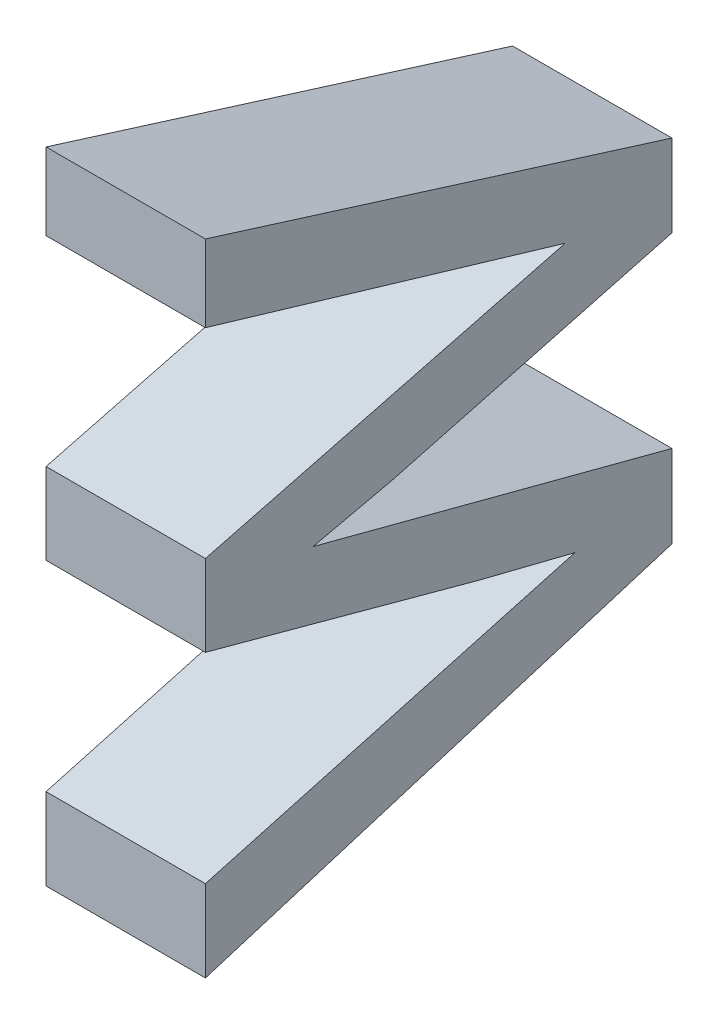
ISO-10303-21;
HEADER;
FILE_DESCRIPTION(('STEP AP214'),'2;1');
FILE_NAME('part.step','',(''),(''),'','','');
FILE_SCHEMA(('AUTOMOTIVE_DESIGN { 1 0 10303 214 1 1 1 1 }'));
ENDSEC;
DATA;
#1=APPLICATION_CONTEXT('core data for automotive mechanical design processes');
#2=APPLICATION_PROTOCOL_DEFINITION('international standard','automotive_design',2000,#1);
#3=PRODUCT_CONTEXT('',#1,'mechanical');
#4=PRODUCT('Part','Part','',(#3));
#5=PRODUCT_RELATED_PRODUCT_CATEGORY('part','',(#4));
#6=PRODUCT_DEFINITION_FORMATION('','',#4);
#7=PRODUCT_DEFINITION_CONTEXT('part definition',#1,'design');
#8=PRODUCT_DEFINITION('design','',#6,#7);
#9=PRODUCT_DEFINITION_SHAPE('','',#8);
#10=(LENGTH_UNIT() NAMED_UNIT(*) SI_UNIT(.MILLI.,.METRE.));
#11=(NAMED_UNIT(*) PLANE_ANGLE_UNIT() SI_UNIT($,.RADIAN.));
#12=(NAMED_UNIT(*) SI_UNIT($,.STERADIAN.) SOLID_ANGLE_UNIT());
#13=UNCERTAINTY_MEASURE_WITH_UNIT(LENGTH_MEASURE(1.E-05),#10,'distance_accuracy_value','');
#14=(GEOMETRIC_REPRESENTATION_CONTEXT(3) GLOBAL_UNCERTAINTY_ASSIGNED_CONTEXT((#13)) GLOBAL_UNIT_ASSIGNED_CONTEXT((#10,
#11,#12)) REPRESENTATION_CONTEXT('',''));
#15=CARTESIAN_POINT('',(0.,0.,0.));
#16=DIRECTION('',(0.,0.,1.));
#17=DIRECTION('',(1.,0.,0.));
#18=AXIS2_PLACEMENT_3D('',#15,#16,#17);
#19=CARTESIAN_POINT('',(4.55229940712934,-40.8328981570271,-8.88282801642506));
#20=DIRECTION('',(-1.,0.,0.));
#21=DIRECTION('',(0.,0.,1.));
#22=AXIS2_PLACEMENT_3D('',#19,#20,#21);
#23=PLANE('',#22);
#24=CARTESIAN_POINT('',(4.55229940712931,-40.570717167468,-9.03684944149135));
#25=CARTESIAN_POINT('',(4.55229940712931,-40.5763680653899,-9.01190279456787));
#26=CARTESIAN_POINT('',(4.55229940712931,-40.5820189633118,-8.98695614764439));
#27=(BOUNDED_CURVE() B_SPLINE_CURVE(2,(#24,#25,#26),.UNSPECIFIED.,.F.,
.F.) B_SPLINE_CURVE_WITH_KNOTS((3,3),(-5.77271874549166,-5.45645160203037),
.UNSPECIFIED.) CURVE() GEOMETRIC_REPRESENTATION_ITEM() RATIONAL_B_SPLINE_CURVE((1.,1.,1.)) REPRESENTATION_ITEM(''));
#28=CARTESIAN_POINT('',(4.55229940712931,-40.570717167468,-9.03684944149135));
#29=VERTEX_POINT('',#28);
#30=CARTESIAN_POINT('',(4.55229940712931,-40.5820189633118,-8.98695614764439));
#31=VERTEX_POINT('',#30);
#32=EDGE_CURVE('E181',#29,#31,#27,.T.);
#33=ORIENTED_EDGE('',*,*,#32,.T.);
#34=CARTESIAN_POINT('',(4.55229940712931,-40.5820189633118,-8.98695614764439));
#35=CARTESIAN_POINT('',(4.55229940712931,-40.6116517207071,-9.09956062574651));
#36=CARTESIAN_POINT('',(4.55229940712932,-40.6412844781024,-9.21216510384864));
#37=(BOUNDED_CURVE() B_SPLINE_CURVE(2,(#34,#35,#36),.UNSPECIFIED.,.F.,
.F.) B_SPLINE_CURVE_WITH_KNOTS((3,3),(-5.45645160203037,-4.01675160835501),
.UNSPECIFIED.) CURVE() GEOMETRIC_REPRESENTATION_ITEM() RATIONAL_B_SPLINE_CURVE((1.,1.,1.)) REPRESENTATION_ITEM(''));
#38=CARTESIAN_POINT('',(4.55229940712932,-40.6412844781024,-9.21216510384864));
#39=VERTEX_POINT('',#38);
#40=EDGE_CURVE('E342',#31,#39,#37,.T.);
#41=ORIENTED_EDGE('',*,*,#40,.T.);
#42=CARTESIAN_POINT('',(4.55229940712932,-40.6412844781024,-9.21216510384864));
#43=CARTESIAN_POINT('',(4.55229940712932,-40.6671959124759,-9.21216510384864));
#44=CARTESIAN_POINT('',(4.55229940712933,-40.6931073468495,-9.21216510384864));
#45=(BOUNDED_CURVE() B_SPLINE_CURVE(2,(#42,#43,#44),.UNSPECIFIED.,.F.,
.F.) B_SPLINE_CURVE_WITH_KNOTS((3,3),(-4.01675160835501,-3.69636987693033),
.UNSPECIFIED.) CURVE() GEOMETRIC_REPRESENTATION_ITEM() RATIONAL_B_SPLINE_CURVE((1.,1.,1.)) REPRESENTATION_ITEM(''));
#46=CARTESIAN_POINT('',(4.55229940712933,-40.6931073468495,-9.21216510384864));
#47=VERTEX_POINT('',#46);
#48=EDGE_CURVE('E391',#39,#47,#45,.T.);
#49=ORIENTED_EDGE('',*,*,#48,.T.);
#50=CARTESIAN_POINT('',(4.55229940712933,-40.6931073468495,-9.21216510384864));
#51=CARTESIAN_POINT('',(4.55229940712933,-40.7379010498889,-9.06579306499374));
#52=CARTESIAN_POINT('',(4.55229940712934,-40.7826947529283,-8.91942102613884));
#53=(BOUNDED_CURVE() B_SPLINE_CURVE(2,(#50,#51,#52),.UNSPECIFIED.,.F.,
.F.) B_SPLINE_CURVE_WITH_KNOTS((3,3),(-3.69636987693033,-1.80370372923866),
.UNSPECIFIED.) CURVE() GEOMETRIC_REPRESENTATION_ITEM() RATIONAL_B_SPLINE_CURVE((1.,1.,1.)) REPRESENTATION_ITEM(''));
#54=CARTESIAN_POINT('',(4.55229940712934,-40.7826947529283,-8.91942102613884));
#55=VERTEX_POINT('',#54);
#56=EDGE_CURVE('E290',#47,#55,#53,.T.);
#57=ORIENTED_EDGE('',*,*,#56,.T.);
#58=CARTESIAN_POINT('',(4.55229940712934,-40.7826947529283,-8.91942102613884));
#59=CARTESIAN_POINT('',(4.55229940712933,-40.7570589721119,-8.91942102613884));
#60=CARTESIAN_POINT('',(4.55229940712933,-40.7314231912955,-8.91942102613884));
#61=(BOUNDED_CURVE() B_SPLINE_CURVE(2,(#58,#59,#60),.UNSPECIFIED.,.F.,
.F.) B_SPLINE_CURVE_WITH_KNOTS((3,3),(-1.80370372923866,-1.48673031410574),
.UNSPECIFIED.) CURVE() GEOMETRIC_REPRESENTATION_ITEM() RATIONAL_B_SPLINE_CURVE((1.,1.,1.)) REPRESENTATION_ITEM(''));
#62=CARTESIAN_POINT('',(4.55229940712933,-40.7314231912955,-8.91942102613884));
#63=VERTEX_POINT('',#62);
#64=EDGE_CURVE('E139',#55,#63,#61,.T.);
#65=ORIENTED_EDGE('',*,*,#64,.T.);
#66=CARTESIAN_POINT('',(4.55229940712933,-40.7314231912955,-8.91942102613884));
#67=CARTESIAN_POINT('',(4.55229940712933,-40.708130465715,-9.00390884141007));
#68=CARTESIAN_POINT('',(4.55229940712932,-40.6761546530838,-9.11982116219818));
#69=CARTESIAN_POINT('',(4.55229940712932,-40.6674715660331,-9.15124566771505));
#70=(BOUNDED_CURVE() B_SPLINE_CURVE(2,(#66,#67,#68,#69),.UNSPECIFIED.,.F.,
.F.) B_SPLINE_CURVE_WITH_KNOTS((3,1,3),(-1.48673031410574,-0.403108154147677,0.),
.UNSPECIFIED.) CURVE() GEOMETRIC_REPRESENTATION_ITEM() RATIONAL_B_SPLINE_CURVE((1.,1.,1.,1.)) REPRESENTATION_ITEM(''));
#71=CARTESIAN_POINT('',(4.55229940712932,-40.6674715660331,-9.15124566771505));
#72=VERTEX_POINT('',#71);
#73=EDGE_CURVE('E310',#63,#72,#70,.T.);
#74=ORIENTED_EDGE('',*,*,#73,.T.);
#75=CARTESIAN_POINT('',(4.55229940712932,-40.6674715660331,-9.15124566771505));
#76=CARTESIAN_POINT('',(4.55229940712932,-40.6663689518044,-9.14655955724323));
#77=CARTESIAN_POINT('',(4.55229940712932,-40.652310620389,-9.0908775386958));
#78=(BOUNDED_CURVE() B_SPLINE_CURVE(2,(#75,#76,#77),.UNSPECIFIED.,.F.,
.F.) B_SPLINE_CURVE_WITH_KNOTS((3,3),(0.,1.),
.UNSPECIFIED.) CURVE() GEOMETRIC_REPRESENTATION_ITEM() RATIONAL_B_SPLINE_CURVE((1.,1.,1.)) REPRESENTATION_ITEM(''));
#79=CARTESIAN_POINT('',(4.55229940712932,-40.652310620389,-9.0908775386958));
#80=VERTEX_POINT('',#79);
#81=EDGE_CURVE('E200',#72,#80,#78,.T.);
#82=ORIENTED_EDGE('',*,*,#81,.T.);
#83=CARTESIAN_POINT('',(4.55229940712932,-40.652310620389,-9.0908775386958));
#84=CARTESIAN_POINT('',(4.55229940712932,-40.6290178948085,-9.00514928241732));
#85=CARTESIAN_POINT('',(4.55229940712931,-40.605725169228,-8.91942102613883));
#86=(BOUNDED_CURVE() B_SPLINE_CURVE(2,(#83,#84,#85),.UNSPECIFIED.,.F.,
.F.) B_SPLINE_CURVE_WITH_KNOTS((3,3),(1.,2.09841552621187),
.UNSPECIFIED.) CURVE() GEOMETRIC_REPRESENTATION_ITEM() RATIONAL_B_SPLINE_CURVE((1.,1.,1.)) REPRESENTATION_ITEM(''));
#87=CARTESIAN_POINT('',(4.55229940712931,-40.605725169228,-8.91942102613883));
#88=VERTEX_POINT('',#87);
#89=EDGE_CURVE('E219',#80,#88,#86,.T.);
#90=ORIENTED_EDGE('',*,*,#89,.T.);
#91=CARTESIAN_POINT('',(4.55229940712931,-40.605725169228,-8.91942102613883));
#92=CARTESIAN_POINT('',(4.55229940712931,-40.5802272151902,-8.91942102613884));
#93=CARTESIAN_POINT('',(4.55229940712931,-40.5547292611524,-8.91942102613883));
#94=(BOUNDED_CURVE() B_SPLINE_CURVE(2,(#91,#92,#93),.UNSPECIFIED.,.F.,
.F.) B_SPLINE_CURVE_WITH_KNOTS((3,3),(2.09841552621187,2.41368478319891),
.UNSPECIFIED.) CURVE() GEOMETRIC_REPRESENTATION_ITEM() RATIONAL_B_SPLINE_CURVE((1.,1.,1.)) REPRESENTATION_ITEM(''));
#95=CARTESIAN_POINT('',(4.55229940712931,-40.5547292611524,-8.91942102613883));
#96=VERTEX_POINT('',#95);
#97=EDGE_CURVE('E260',#88,#96,#94,.T.);
#98=ORIENTED_EDGE('',*,*,#97,.T.);
#99=CARTESIAN_POINT('',(4.55229940712931,-40.5547292611524,-8.91942102613883));
#100=CARTESIAN_POINT('',(4.5522994071293,-40.5328148033577,-9.00432232174582));
#101=CARTESIAN_POINT('',(4.5522994071293,-40.5035955262982,-9.11720245340511));
#102=CARTESIAN_POINT('',(4.5522994071293,-40.4962907070333,-9.14518128945741));
#103=(BOUNDED_CURVE() B_SPLINE_CURVE(2,(#99,#100,#101,#102),.UNSPECIFIED.,.F.,
.F.) B_SPLINE_CURVE_WITH_KNOTS((3,1,3),(2.41368478319891,3.49785219491702,3.85539253415245),
.UNSPECIFIED.) CURVE() GEOMETRIC_REPRESENTATION_ITEM() RATIONAL_B_SPLINE_CURVE((1.,1.,1.,1.)) REPRESENTATION_ITEM(''));
#104=CARTESIAN_POINT('',(4.5522994071293,-40.4962907070333,-9.14518128945741));
#105=VERTEX_POINT('',#104);
#106=EDGE_CURVE('E362',#96,#105,#103,.T.);
#107=ORIENTED_EDGE('',*,*,#106,.T.);
#108=CARTESIAN_POINT('',(4.5522994071293,-40.4962907070333,-9.14518128945741));
#109=CARTESIAN_POINT('',(4.5522994071293,-40.4878832735397,-9.11692679984794));
#110=CARTESIAN_POINT('',(4.55229940712929,-40.4543913663441,-9.00404666818865));
#111=CARTESIAN_POINT('',(4.55229940712929,-40.4293068926421,-8.91942102613884));
#112=(BOUNDED_CURVE() B_SPLINE_CURVE(2,(#108,#109,#110,#111),.UNSPECIFIED.,.F.,
.F.) B_SPLINE_CURVE_WITH_KNOTS((3,1,3),(3.85539253415245,4.2198832391048,5.31123654712288),
.UNSPECIFIED.) CURVE() GEOMETRIC_REPRESENTATION_ITEM() RATIONAL_B_SPLINE_CURVE((1.,1.,1.,1.)) REPRESENTATION_ITEM(''));
#113=CARTESIAN_POINT('',(4.55229940712929,-40.4293068926421,-8.91942102613884));
#114=VERTEX_POINT('',#113);
#115=EDGE_CURVE('E230',#105,#114,#112,.T.);
#116=ORIENTED_EDGE('',*,*,#115,.T.);
#117=CARTESIAN_POINT('',(4.55229940712929,-40.4293068926421,-8.91942102613884));
#118=CARTESIAN_POINT('',(4.55229940712928,-40.4051872063901,-8.91942102613884));
#119=CARTESIAN_POINT('',(4.55229940712928,-40.3810675201381,-8.91942102613883));
#120=(BOUNDED_CURVE() B_SPLINE_CURVE(2,(#117,#118,#119),.UNSPECIFIED.,.F.,
.F.) B_SPLINE_CURVE_WITH_KNOTS((3,3),(5.31123654712288,5.60946422265117),
.UNSPECIFIED.) CURVE() GEOMETRIC_REPRESENTATION_ITEM() RATIONAL_B_SPLINE_CURVE((1.,1.,1.)) REPRESENTATION_ITEM(''));
#121=CARTESIAN_POINT('',(4.55229940712928,-40.3810675201381,-8.91942102613883));
#122=VERTEX_POINT('',#121);
#123=EDGE_CURVE('E239',#114,#122,#120,.T.);
#124=ORIENTED_EDGE('',*,*,#123,.T.);
#125=CARTESIAN_POINT('',(4.55229940712928,-40.3810675201381,-8.91942102613883));
#126=CARTESIAN_POINT('',(4.55229940712929,-40.4268260106276,-9.06579306499374));
#127=CARTESIAN_POINT('',(4.5522994071293,-40.472584501117,-9.21216510384864));
#128=(BOUNDED_CURVE() B_SPLINE_CURVE(2,(#125,#126,#127),.UNSPECIFIED.,.F.,
.F.) B_SPLINE_CURVE_WITH_KNOTS((3,3),(5.60946422265117,7.50565549870941),
.UNSPECIFIED.) CURVE() GEOMETRIC_REPRESENTATION_ITEM() RATIONAL_B_SPLINE_CURVE((1.,1.,1.)) REPRESENTATION_ITEM(''));
#129=CARTESIAN_POINT('',(4.5522994071293,-40.472584501117,-9.21216510384864));
#130=VERTEX_POINT('',#129);
#131=EDGE_CURVE('E332',#122,#130,#128,.T.);
#132=ORIENTED_EDGE('',*,*,#131,.T.);
#133=CARTESIAN_POINT('',(4.5522994071293,-40.472584501117,-9.21216510384864));
#134=CARTESIAN_POINT('',(4.5522994071293,-40.498358108712,-9.21216510384864));
#135=CARTESIAN_POINT('',(4.5522994071293,-40.524131716307,-9.21216510384864));
#136=(BOUNDED_CURVE() B_SPLINE_CURVE(2,(#133,#134,#135),.UNSPECIFIED.,.F.,
.F.) B_SPLINE_CURVE_WITH_KNOTS((3,3),(7.50565549870941,7.8243330719882),
.UNSPECIFIED.) CURVE() GEOMETRIC_REPRESENTATION_ITEM() RATIONAL_B_SPLINE_CURVE((1.,1.,1.)) REPRESENTATION_ITEM(''));
#137=CARTESIAN_POINT('',(4.5522994071293,-40.524131716307,-9.21216510384864));
#138=VERTEX_POINT('',#137);
#139=EDGE_CURVE('E173',#130,#138,#136,.T.);
#140=ORIENTED_EDGE('',*,*,#139,.T.);
#141=CARTESIAN_POINT('',(4.5522994071293,-40.524131716307,-9.21216510384864));
#142=CARTESIAN_POINT('',(4.55229940712931,-40.5474244418875,-9.12450727267));
#143=CARTESIAN_POINT('',(4.55229940712931,-40.570717167468,-9.03684944149135));
#144=(BOUNDED_CURVE() B_SPLINE_CURVE(2,(#141,#142,#143),.UNSPECIFIED.,.F.,
.F.) B_SPLINE_CURVE_WITH_KNOTS((3,3),(7.8243330719882,8.94578955613703),
.UNSPECIFIED.) CURVE() GEOMETRIC_REPRESENTATION_ITEM() RATIONAL_B_SPLINE_CURVE((1.,1.,1.)) REPRESENTATION_ITEM(''));
#145=EDGE_CURVE('E11',#138,#29,#144,.T.);
#146=ORIENTED_EDGE('',*,*,#145,.T.);
#147=EDGE_LOOP('',(#33,#41,#49,#57,#65,#74,#82,#90,#98,#107,#116,#124,#132,#140,#146));
#148=FACE_BOUND('',#147,.T.);
#149=ADVANCED_FACE('F16',(#148),#23,.T.);
#150=CARTESIAN_POINT('',(4.65229940712935,-40.8328981570271,-8.88282801642507));
#151=DIRECTION('',(1.,0.,0.));
#152=DIRECTION('',(0.,1.,0.));
#153=AXIS2_PLACEMENT_3D('',#150,#151,#152);
#154=PLANE('',#153);
#155=CARTESIAN_POINT('',(4.65229940712931,-40.524131716307,-9.21216510384864));
#156=CARTESIAN_POINT('',(4.65229940712931,-40.5474244418875,-9.12450727267));
#157=CARTESIAN_POINT('',(4.65229940712931,-40.570717167468,-9.03684944149136));
#158=(BOUNDED_CURVE() B_SPLINE_CURVE(2,(#155,#156,#157),.UNSPECIFIED.,.F.,
.F.) B_SPLINE_CURVE_WITH_KNOTS((3,3),(7.8243330719882,8.94578955613703),
.UNSPECIFIED.) CURVE() GEOMETRIC_REPRESENTATION_ITEM() RATIONAL_B_SPLINE_CURVE((1.,1.,1.)) REPRESENTATION_ITEM(''));
#159=CARTESIAN_POINT('',(4.65229940712931,-40.524131716307,-9.21216510384864));
#160=VERTEX_POINT('',#159);
#161=CARTESIAN_POINT('',(4.65229940712931,-40.570717167468,-9.03684944149136));
#162=VERTEX_POINT('',#161);
#163=EDGE_CURVE('E31',#160,#162,#158,.T.);
#164=ORIENTED_EDGE('',*,*,#163,.F.);
#165=CARTESIAN_POINT('',(4.6522994071293,-40.472584501117,-9.21216510384864));
#166=CARTESIAN_POINT('',(4.6522994071293,-40.498358108712,-9.21216510384864));
#167=CARTESIAN_POINT('',(4.65229940712931,-40.524131716307,-9.21216510384864));
#168=(BOUNDED_CURVE() B_SPLINE_CURVE(2,(#165,#166,#167),.UNSPECIFIED.,.F.,
.F.) B_SPLINE_CURVE_WITH_KNOTS((3,3),(7.50565549870941,7.8243330719882),
.UNSPECIFIED.) CURVE() GEOMETRIC_REPRESENTATION_ITEM() RATIONAL_B_SPLINE_CURVE((1.,1.,1.)) REPRESENTATION_ITEM(''));
#169=CARTESIAN_POINT('',(4.6522994071293,-40.472584501117,-9.21216510384864));
#170=VERTEX_POINT('',#169);
#171=EDGE_CURVE('E341',#170,#160,#168,.T.);
#172=ORIENTED_EDGE('',*,*,#171,.F.);
#173=CARTESIAN_POINT('',(4.65229940712928,-40.3810675201381,-8.91942102613883));
#174=CARTESIAN_POINT('',(4.65229940712929,-40.4268260106276,-9.06579306499374));
#175=CARTESIAN_POINT('',(4.6522994071293,-40.472584501117,-9.21216510384864));
#176=(BOUNDED_CURVE() B_SPLINE_CURVE(2,(#173,#174,#175),.UNSPECIFIED.,.F.,
.F.) B_SPLINE_CURVE_WITH_KNOTS((3,3),(5.60946422265117,7.50565549870941),
.UNSPECIFIED.) CURVE() GEOMETRIC_REPRESENTATION_ITEM() RATIONAL_B_SPLINE_CURVE((1.,1.,1.)) REPRESENTATION_ITEM(''));
#177=CARTESIAN_POINT('',(4.65229940712928,-40.3810675201381,-8.91942102613883));
#178=VERTEX_POINT('',#177);
#179=EDGE_CURVE('E240',#178,#170,#176,.T.);
#180=ORIENTED_EDGE('',*,*,#179,.F.);
#181=CARTESIAN_POINT('',(4.65229940712929,-40.429306892642,-8.91942102613884));
#182=CARTESIAN_POINT('',(4.65229940712929,-40.4051872063901,-8.91942102613884));
#183=CARTESIAN_POINT('',(4.65229940712928,-40.3810675201381,-8.91942102613883));
#184=(BOUNDED_CURVE() B_SPLINE_CURVE(2,(#181,#182,#183),.UNSPECIFIED.,.F.,
.F.) B_SPLINE_CURVE_WITH_KNOTS((3,3),(5.31123654712288,5.60946422265117),
.UNSPECIFIED.) CURVE() GEOMETRIC_REPRESENTATION_ITEM() RATIONAL_B_SPLINE_CURVE((1.,1.,1.)) REPRESENTATION_ITEM(''));
#185=CARTESIAN_POINT('',(4.65229940712929,-40.429306892642,-8.91942102613884));
#186=VERTEX_POINT('',#185);
#187=EDGE_CURVE('E220',#186,#178,#184,.T.);
#188=ORIENTED_EDGE('',*,*,#187,.F.);
#189=CARTESIAN_POINT('',(4.6522994071293,-40.4962907070333,-9.14518128945742));
#190=CARTESIAN_POINT('',(4.6522994071293,-40.4878832735397,-9.11692679984795));
#191=CARTESIAN_POINT('',(4.65229940712929,-40.4543913663441,-9.00404666818866));
#192=CARTESIAN_POINT('',(4.65229940712929,-40.429306892642,-8.91942102613884));
#193=(BOUNDED_CURVE() B_SPLINE_CURVE(2,(#189,#190,#191,#192),.UNSPECIFIED.,.F.,
.F.) B_SPLINE_CURVE_WITH_KNOTS((3,1,3),(3.85539253415245,4.2198832391048,5.31123654712288),
.UNSPECIFIED.) CURVE() GEOMETRIC_REPRESENTATION_ITEM() RATIONAL_B_SPLINE_CURVE((1.,1.,1.,1.)) REPRESENTATION_ITEM(''));
#194=CARTESIAN_POINT('',(4.6522994071293,-40.4962907070333,-9.14518128945742));
#195=VERTEX_POINT('',#194);
#196=EDGE_CURVE('E353',#195,#186,#193,.T.);
#197=ORIENTED_EDGE('',*,*,#196,.F.);
#198=CARTESIAN_POINT('',(4.65229940712931,-40.5547292611524,-8.91942102613883));
#199=CARTESIAN_POINT('',(4.6522994071293,-40.5328148033577,-9.00432232174582));
#200=CARTESIAN_POINT('',(4.6522994071293,-40.5035955262982,-9.11720245340511));
#201=CARTESIAN_POINT('',(4.6522994071293,-40.4962907070333,-9.14518128945742));
#202=(BOUNDED_CURVE() B_SPLINE_CURVE(2,(#198,#199,#200,#201),.UNSPECIFIED.,.F.,
.F.) B_SPLINE_CURVE_WITH_KNOTS((3,1,3),(2.41368478319891,3.49785219491702,3.85539253415245),
.UNSPECIFIED.) CURVE() GEOMETRIC_REPRESENTATION_ITEM() RATIONAL_B_SPLINE_CURVE((1.,1.,1.,1.)) REPRESENTATION_ITEM(''));
#203=CARTESIAN_POINT('',(4.65229940712931,-40.5547292611524,-8.91942102613883));
#204=VERTEX_POINT('',#203);
#205=EDGE_CURVE('E250',#204,#195,#202,.T.);
#206=ORIENTED_EDGE('',*,*,#205,.F.);
#207=CARTESIAN_POINT('',(4.65229940712931,-40.605725169228,-8.91942102613883));
#208=CARTESIAN_POINT('',(4.65229940712931,-40.5802272151902,-8.91942102613884));
#209=CARTESIAN_POINT('',(4.65229940712931,-40.5547292611524,-8.91942102613883));
#210=(BOUNDED_CURVE() B_SPLINE_CURVE(2,(#207,#208,#209),.UNSPECIFIED.,.F.,
.F.) B_SPLINE_CURVE_WITH_KNOTS((3,3),(2.09841552621187,2.41368478319891),
.UNSPECIFIED.) CURVE() GEOMETRIC_REPRESENTATION_ITEM() RATIONAL_B_SPLINE_CURVE((1.,1.,1.)) REPRESENTATION_ITEM(''));
#211=CARTESIAN_POINT('',(4.65229940712931,-40.605725169228,-8.91942102613883));
#212=VERTEX_POINT('',#211);
#213=EDGE_CURVE('E270',#212,#204,#210,.T.);
#214=ORIENTED_EDGE('',*,*,#213,.F.);
#215=CARTESIAN_POINT('',(4.65229940712932,-40.652310620389,-9.0908775386958));
#216=CARTESIAN_POINT('',(4.65229940712932,-40.6290178948085,-9.00514928241732));
#217=CARTESIAN_POINT('',(4.65229940712931,-40.605725169228,-8.91942102613883));
#218=(BOUNDED_CURVE() B_SPLINE_CURVE(2,(#215,#216,#217),.UNSPECIFIED.,.F.,
.F.) B_SPLINE_CURVE_WITH_KNOTS((3,3),(1.,2.09841552621187),
.UNSPECIFIED.) CURVE() GEOMETRIC_REPRESENTATION_ITEM() RATIONAL_B_SPLINE_CURVE((1.,1.,1.)) REPRESENTATION_ITEM(''));
#219=CARTESIAN_POINT('',(4.65229940712932,-40.652310620389,-9.0908775386958));
#220=VERTEX_POINT('',#219);
#221=EDGE_CURVE('E208',#220,#212,#218,.T.);
#222=ORIENTED_EDGE('',*,*,#221,.F.);
#223=CARTESIAN_POINT('',(4.65229940712933,-40.6674715660331,-9.15124566771505));
#224=CARTESIAN_POINT('',(4.65229940712933,-40.6663689518044,-9.14655955724324));
#225=CARTESIAN_POINT('',(4.65229940712932,-40.652310620389,-9.0908775386958));
#226=(BOUNDED_CURVE() B_SPLINE_CURVE(2,(#223,#224,#225),.UNSPECIFIED.,.F.,
.F.) B_SPLINE_CURVE_WITH_KNOTS((3,3),(0.,1.),
.UNSPECIFIED.) CURVE() GEOMETRIC_REPRESENTATION_ITEM() RATIONAL_B_SPLINE_CURVE((1.,1.,1.)) REPRESENTATION_ITEM(''));
#227=CARTESIAN_POINT('',(4.65229940712933,-40.6674715660331,-9.15124566771505));
#228=VERTEX_POINT('',#227);
#229=EDGE_CURVE('E405',#228,#220,#226,.T.);
#230=ORIENTED_EDGE('',*,*,#229,.F.);
#231=CARTESIAN_POINT('',(4.65229940712933,-40.7314231912955,-8.91942102613884));
#232=CARTESIAN_POINT('',(4.65229940712933,-40.708130465715,-9.00390884141007));
#233=CARTESIAN_POINT('',(4.65229940712933,-40.6761546530838,-9.11982116219818));
#234=CARTESIAN_POINT('',(4.65229940712933,-40.6674715660331,-9.15124566771505));
#235=(BOUNDED_CURVE() B_SPLINE_CURVE(2,(#231,#232,#233,#234),.UNSPECIFIED.,.F.,
.F.) B_SPLINE_CURVE_WITH_KNOTS((3,1,3),(-1.48673031410574,-0.403108154147677,0.),
.UNSPECIFIED.) CURVE() GEOMETRIC_REPRESENTATION_ITEM() RATIONAL_B_SPLINE_CURVE((1.,1.,1.,1.)) REPRESENTATION_ITEM(''));
#236=CARTESIAN_POINT('',(4.65229940712933,-40.7314231912955,-8.91942102613884));
#237=VERTEX_POINT('',#236);
#238=EDGE_CURVE('E149',#237,#228,#235,.T.);
#239=ORIENTED_EDGE('',*,*,#238,.F.);
#240=CARTESIAN_POINT('',(4.65229940712934,-40.7826947529283,-8.91942102613884));
#241=CARTESIAN_POINT('',(4.65229940712933,-40.7570589721119,-8.91942102613884));
#242=CARTESIAN_POINT('',(4.65229940712933,-40.7314231912955,-8.91942102613884));
#243=(BOUNDED_CURVE() B_SPLINE_CURVE(2,(#240,#241,#242),.UNSPECIFIED.,.F.,
.F.) B_SPLINE_CURVE_WITH_KNOTS((3,3),(-1.80370372923866,-1.48673031410574),
.UNSPECIFIED.) CURVE() GEOMETRIC_REPRESENTATION_ITEM() RATIONAL_B_SPLINE_CURVE((1.,1.,1.)) REPRESENTATION_ITEM(''));
#244=CARTESIAN_POINT('',(4.65229940712934,-40.7826947529283,-8.91942102613884));
#245=VERTEX_POINT('',#244);
#246=EDGE_CURVE('E280',#245,#237,#243,.T.);
#247=ORIENTED_EDGE('',*,*,#246,.F.);
#248=CARTESIAN_POINT('',(4.65229940712933,-40.6931073468495,-9.21216510384864));
#249=CARTESIAN_POINT('',(4.65229940712933,-40.7379010498889,-9.06579306499374));
#250=CARTESIAN_POINT('',(4.65229940712934,-40.7826947529283,-8.91942102613884));
#251=(BOUNDED_CURVE() B_SPLINE_CURVE(2,(#248,#249,#250),.UNSPECIFIED.,.F.,
.F.) B_SPLINE_CURVE_WITH_KNOTS((3,3),(-3.69636987693033,-1.80370372923866),
.UNSPECIFIED.) CURVE() GEOMETRIC_REPRESENTATION_ITEM() RATIONAL_B_SPLINE_CURVE((1.,1.,1.)) REPRESENTATION_ITEM(''));
#252=CARTESIAN_POINT('',(4.65229940712933,-40.6931073468495,-9.21216510384864));
#253=VERTEX_POINT('',#252);
#254=EDGE_CURVE('E378',#253,#245,#251,.T.);
#255=ORIENTED_EDGE('',*,*,#254,.F.);
#256=CARTESIAN_POINT('',(4.65229940712932,-40.6412844781024,-9.21216510384864));
#257=CARTESIAN_POINT('',(4.65229940712933,-40.6671959124759,-9.21216510384864));
#258=CARTESIAN_POINT('',(4.65229940712933,-40.6931073468495,-9.21216510384864));
#259=(BOUNDED_CURVE() B_SPLINE_CURVE(2,(#256,#257,#258),.UNSPECIFIED.,.F.,
.F.) B_SPLINE_CURVE_WITH_KNOTS((3,3),(-4.01675160835501,-3.69636987693033),
.UNSPECIFIED.) CURVE() GEOMETRIC_REPRESENTATION_ITEM() RATIONAL_B_SPLINE_CURVE((1.,1.,1.)) REPRESENTATION_ITEM(''));
#260=CARTESIAN_POINT('',(4.65229940712932,-40.6412844781024,-9.21216510384864));
#261=VERTEX_POINT('',#260);
#262=EDGE_CURVE('E351',#261,#253,#259,.T.);
#263=ORIENTED_EDGE('',*,*,#262,.F.);
#264=CARTESIAN_POINT('',(4.65229940712931,-40.5820189633117,-8.98695614764439));
#265=CARTESIAN_POINT('',(4.65229940712932,-40.611651720707,-9.09956062574651));
#266=CARTESIAN_POINT('',(4.65229940712932,-40.6412844781024,-9.21216510384864));
#267=(BOUNDED_CURVE() B_SPLINE_CURVE(2,(#264,#265,#266),.UNSPECIFIED.,.F.,
.F.) B_SPLINE_CURVE_WITH_KNOTS((3,3),(-5.45645160203037,-4.01675160835501),
.UNSPECIFIED.) CURVE() GEOMETRIC_REPRESENTATION_ITEM() RATIONAL_B_SPLINE_CURVE((1.,1.,1.)) REPRESENTATION_ITEM(''));
#268=CARTESIAN_POINT('',(4.65229940712931,-40.5820189633117,-8.98695614764439));
#269=VERTEX_POINT('',#268);
#270=EDGE_CURVE('E183',#269,#261,#267,.T.);
#271=ORIENTED_EDGE('',*,*,#270,.F.);
#272=CARTESIAN_POINT('',(4.65229940712931,-40.570717167468,-9.03684944149136));
#273=CARTESIAN_POINT('',(4.65229940712931,-40.5763680653899,-9.01190279456787));
#274=CARTESIAN_POINT('',(4.65229940712931,-40.5820189633117,-8.98695614764439));
#275=(BOUNDED_CURVE() B_SPLINE_CURVE(2,(#272,#273,#274),.UNSPECIFIED.,.F.,
.F.) B_SPLINE_CURVE_WITH_KNOTS((3,3),(-5.77271874549166,-5.45645160203037),
.UNSPECIFIED.) CURVE() GEOMETRIC_REPRESENTATION_ITEM() RATIONAL_B_SPLINE_CURVE((1.,1.,1.)) REPRESENTATION_ITEM(''));
#276=EDGE_CURVE('E179',#162,#269,#275,.T.);
#277=ORIENTED_EDGE('',*,*,#276,.F.);
#278=EDGE_LOOP('',(#164,#172,#180,#188,#197,#206,#214,#222,#230,#239,#247,#255,#263,#271,#277));
#279=FACE_BOUND('',#278,.T.);
#280=ADVANCED_FACE('F185',(#279),#154,.T.);
#281=CARTESIAN_POINT('',(4.65229940712931,-40.524131716307,-9.21216510384864));
#282=CARTESIAN_POINT('',(4.5522994071293,-40.524131716307,-9.21216510384864));
#283=CARTESIAN_POINT('',(4.65229940712931,-40.5474244418875,-9.12450727267));
#284=CARTESIAN_POINT('',(4.55229940712931,-40.5474244418875,-9.12450727267));
#285=CARTESIAN_POINT('',(4.65229940712931,-40.570717167468,-9.03684944149136));
#286=CARTESIAN_POINT('',(4.55229940712931,-40.570717167468,-9.03684944149135));
#287=(BOUNDED_SURFACE() B_SPLINE_SURFACE(2,1,((#281,#282),(#283,#284),(#285,#286)),
.UNSPECIFIED.,.F.,.F.,.F.) B_SPLINE_SURFACE_WITH_KNOTS((3,3),(2,2),(7.8243330719882,
8.94578955613703),(0.,0.1),
.UNSPECIFIED.) GEOMETRIC_REPRESENTATION_ITEM() RATIONAL_B_SPLINE_SURFACE(((1.,1.),(1.,1.),(1.,1.))) REPRESENTATION_ITEM('') SURFACE());
#288=CARTESIAN_POINT('',(4.65229940712931,-40.570717167468,-9.03684944149136));
#289=CARTESIAN_POINT('',(4.55229940712931,-40.570717167468,-9.03684944149135));
#290=(BOUNDED_CURVE() B_SPLINE_CURVE(1,(#288,#289),.UNSPECIFIED.,.F.,
.F.) B_SPLINE_CURVE_WITH_KNOTS((2,2),(0.,0.1),
.UNSPECIFIED.) CURVE() GEOMETRIC_REPRESENTATION_ITEM() RATIONAL_B_SPLINE_CURVE((1.,1.)) REPRESENTATION_ITEM(''));
#291=EDGE_CURVE('E166',#162,#29,#290,.T.);
#292=CARTESIAN_POINT('',(4.65229940712931,-40.524131716307,-9.21216510384864));
#293=CARTESIAN_POINT('',(4.5522994071293,-40.524131716307,-9.21216510384864));
#294=(BOUNDED_CURVE() B_SPLINE_CURVE(1,(#292,#293),.UNSPECIFIED.,.F.,
.F.) B_SPLINE_CURVE_WITH_KNOTS((2,2),(0.,0.1),
.UNSPECIFIED.) CURVE() GEOMETRIC_REPRESENTATION_ITEM() RATIONAL_B_SPLINE_CURVE((1.,1.)) REPRESENTATION_ITEM(''));
#295=EDGE_CURVE('E169',#160,#138,#294,.T.);
#296=ORIENTED_EDGE('',*,*,#163,.T.);
#297=ORIENTED_EDGE('',*,*,#291,.T.);
#298=ORIENTED_EDGE('',*,*,#145,.F.);
#299=ORIENTED_EDGE('',*,*,#295,.F.);
#300=EDGE_LOOP('',(#296,#297,#298,#299));
#301=FACE_BOUND('',#300,.T.);
#302=ADVANCED_FACE('F165',(#301),#287,.T.);
#303=CARTESIAN_POINT('',(4.6522994071293,-40.472584501117,-9.21216510384864));
#304=CARTESIAN_POINT('',(4.5522994071293,-40.472584501117,-9.21216510384864));
#305=CARTESIAN_POINT('',(4.6522994071293,-40.498358108712,-9.21216510384864));
#306=CARTESIAN_POINT('',(4.5522994071293,-40.498358108712,-9.21216510384864));
#307=CARTESIAN_POINT('',(4.65229940712931,-40.524131716307,-9.21216510384864));
#308=CARTESIAN_POINT('',(4.5522994071293,-40.524131716307,-9.21216510384864));
#309=(BOUNDED_SURFACE() B_SPLINE_SURFACE(2,1,((#303,#304),(#305,#306),(#307,#308)),
.UNSPECIFIED.,.F.,.F.,.F.) B_SPLINE_SURFACE_WITH_KNOTS((3,3),(2,2),(7.50565549870941,
7.8243330719882),(0.,0.1),
.UNSPECIFIED.) GEOMETRIC_REPRESENTATION_ITEM() RATIONAL_B_SPLINE_SURFACE(((1.,1.),(1.,1.),(1.,1.))) REPRESENTATION_ITEM('') SURFACE());
#310=CARTESIAN_POINT('',(4.6522994071293,-40.472584501117,-9.21216510384864));
#311=CARTESIAN_POINT('',(4.5522994071293,-40.472584501117,-9.21216510384864));
#312=(BOUNDED_CURVE() B_SPLINE_CURVE(1,(#310,#311),.UNSPECIFIED.,.F.,
.F.) B_SPLINE_CURVE_WITH_KNOTS((2,2),(0.,0.1),
.UNSPECIFIED.) CURVE() GEOMETRIC_REPRESENTATION_ITEM() RATIONAL_B_SPLINE_CURVE((1.,1.)) REPRESENTATION_ITEM(''));
#313=EDGE_CURVE('E249',#170,#130,#312,.T.);
#314=ORIENTED_EDGE('',*,*,#171,.T.);
#315=ORIENTED_EDGE('',*,*,#295,.T.);
#316=ORIENTED_EDGE('',*,*,#139,.F.);
#317=ORIENTED_EDGE('',*,*,#313,.F.);
#318=EDGE_LOOP('',(#314,#315,#316,#317));
#319=FACE_BOUND('',#318,.T.);
#320=ADVANCED_FACE('F639',(#319),#309,.T.);
#321=CARTESIAN_POINT('',(4.65229940712928,-40.3810675201381,-8.91942102613883));
#322=CARTESIAN_POINT('',(4.55229940712928,-40.3810675201381,-8.91942102613883));
#323=CARTESIAN_POINT('',(4.65229940712929,-40.4268260106276,-9.06579306499374));
#324=CARTESIAN_POINT('',(4.55229940712929,-40.4268260106276,-9.06579306499374));
#325=CARTESIAN_POINT('',(4.6522994071293,-40.472584501117,-9.21216510384864));
#326=CARTESIAN_POINT('',(4.5522994071293,-40.472584501117,-9.21216510384864));
#327=(BOUNDED_SURFACE() B_SPLINE_SURFACE(2,1,((#321,#322),(#323,#324),(#325,#326)),
.UNSPECIFIED.,.F.,.F.,.F.) B_SPLINE_SURFACE_WITH_KNOTS((3,3),(2,2),(5.60946422265117,
7.50565549870941),(0.,0.1),
.UNSPECIFIED.) GEOMETRIC_REPRESENTATION_ITEM() RATIONAL_B_SPLINE_SURFACE(((1.,1.),(1.,1.),(1.,1.))) REPRESENTATION_ITEM('') SURFACE());
#328=CARTESIAN_POINT('',(4.65229940712928,-40.3810675201381,-8.91942102613883));
#329=CARTESIAN_POINT('',(4.55229940712928,-40.3810675201381,-8.91942102613883));
#330=(BOUNDED_CURVE() B_SPLINE_CURVE(1,(#328,#329),.UNSPECIFIED.,.F.,
.F.) B_SPLINE_CURVE_WITH_KNOTS((2,2),(0.,0.1),
.UNSPECIFIED.) CURVE() GEOMETRIC_REPRESENTATION_ITEM() RATIONAL_B_SPLINE_CURVE((1.,1.)) REPRESENTATION_ITEM(''));
#331=EDGE_CURVE('E229',#178,#122,#330,.T.);
#332=ORIENTED_EDGE('',*,*,#179,.T.);
#333=ORIENTED_EDGE('',*,*,#313,.T.);
#334=ORIENTED_EDGE('',*,*,#131,.F.);
#335=ORIENTED_EDGE('',*,*,#331,.F.);
#336=EDGE_LOOP('',(#332,#333,#334,#335));
#337=FACE_BOUND('',#336,.T.);
#338=ADVANCED_FACE('F637',(#337),#327,.T.);
#339=CARTESIAN_POINT('',(4.65229940712929,-40.429306892642,-8.91942102613884));
#340=CARTESIAN_POINT('',(4.55229940712929,-40.4293068926421,-8.91942102613884));
#341=CARTESIAN_POINT('',(4.65229940712929,-40.4051872063901,-8.91942102613884));
#342=CARTESIAN_POINT('',(4.55229940712928,-40.4051872063901,-8.91942102613884));
#343=CARTESIAN_POINT('',(4.65229940712928,-40.3810675201381,-8.91942102613883));
#344=CARTESIAN_POINT('',(4.55229940712928,-40.3810675201381,-8.91942102613883));
#345=(BOUNDED_SURFACE() B_SPLINE_SURFACE(2,1,((#339,#340),(#341,#342),(#343,#344)),
.UNSPECIFIED.,.F.,.F.,.F.) B_SPLINE_SURFACE_WITH_KNOTS((3,3),(2,2),(5.31123654712288,
5.60946422265117),(0.,0.1),
.UNSPECIFIED.) GEOMETRIC_REPRESENTATION_ITEM() RATIONAL_B_SPLINE_SURFACE(((1.,1.),(1.,1.),(1.,1.))) REPRESENTATION_ITEM('') SURFACE());
#346=CARTESIAN_POINT('',(4.65229940712929,-40.429306892642,-8.91942102613884));
#347=CARTESIAN_POINT('',(4.55229940712929,-40.4293068926421,-8.91942102613884));
#348=(BOUNDED_CURVE() B_SPLINE_CURVE(1,(#346,#347),.UNSPECIFIED.,.F.,
.F.) B_SPLINE_CURVE_WITH_KNOTS((2,2),(0.,0.1),
.UNSPECIFIED.) CURVE() GEOMETRIC_REPRESENTATION_ITEM() RATIONAL_B_SPLINE_CURVE((1.,1.)) REPRESENTATION_ITEM(''));
#349=EDGE_CURVE('E279',#186,#114,#348,.T.);
#350=ORIENTED_EDGE('',*,*,#187,.T.);
#351=ORIENTED_EDGE('',*,*,#331,.T.);
#352=ORIENTED_EDGE('',*,*,#123,.F.);
#353=ORIENTED_EDGE('',*,*,#349,.F.);
#354=EDGE_LOOP('',(#350,#351,#352,#353));
#355=FACE_BOUND('',#354,.T.);
#356=ADVANCED_FACE('F634',(#355),#345,.T.);
#357=CARTESIAN_POINT('',(4.6522994071293,-40.4962907070333,-9.14518128945742));
#358=CARTESIAN_POINT('',(4.5522994071293,-40.4962907070333,-9.14518128945741));
#359=CARTESIAN_POINT('',(4.6522994071293,-40.4878832735397,-9.11692679984795));
#360=CARTESIAN_POINT('',(4.5522994071293,-40.4878832735397,-9.11692679984794));
#361=CARTESIAN_POINT('',(4.65229940712929,-40.4543913663441,-9.00404666818866));
#362=CARTESIAN_POINT('',(4.55229940712929,-40.4543913663441,-9.00404666818865));
#363=CARTESIAN_POINT('',(4.65229940712929,-40.429306892642,-8.91942102613884));
#364=CARTESIAN_POINT('',(4.55229940712929,-40.4293068926421,-8.91942102613884));
#365=(BOUNDED_SURFACE() B_SPLINE_SURFACE(2,1,((#357,#358),(#359,#360),(#361,#362),(#363,#364)),
.UNSPECIFIED.,.F.,.F.,.F.) B_SPLINE_SURFACE_WITH_KNOTS((3,1,3),(2,2),(3.85539253415245,
4.2198832391048,5.31123654712288),(0.,0.1),
.UNSPECIFIED.) GEOMETRIC_REPRESENTATION_ITEM() RATIONAL_B_SPLINE_SURFACE(((1.,1.),(1.,1.),(1.,
1.),(1.,1.))) REPRESENTATION_ITEM('') SURFACE());
#366=CARTESIAN_POINT('',(4.6522994071293,-40.4962907070333,-9.14518128945742));
#367=CARTESIAN_POINT('',(4.5522994071293,-40.4962907070333,-9.14518128945741));
#368=(BOUNDED_CURVE() B_SPLINE_CURVE(1,(#366,#367),.UNSPECIFIED.,.F.,
.F.) B_SPLINE_CURVE_WITH_KNOTS((2,2),(0.,0.1),
.UNSPECIFIED.) CURVE() GEOMETRIC_REPRESENTATION_ITEM() RATIONAL_B_SPLINE_CURVE((1.,1.)) REPRESENTATION_ITEM(''));
#369=EDGE_CURVE('E259',#195,#105,#368,.T.);
#370=ORIENTED_EDGE('',*,*,#196,.T.);
#371=ORIENTED_EDGE('',*,*,#349,.T.);
#372=ORIENTED_EDGE('',*,*,#115,.F.);
#373=ORIENTED_EDGE('',*,*,#369,.F.);
#374=EDGE_LOOP('',(#370,#371,#372,#373));
#375=FACE_BOUND('',#374,.T.);
#376=ADVANCED_FACE('F627',(#375),#365,.T.);
#377=CARTESIAN_POINT('',(4.65229940712931,-40.5547292611524,-8.91942102613883));
#378=CARTESIAN_POINT('',(4.55229940712931,-40.5547292611524,-8.91942102613883));
#379=CARTESIAN_POINT('',(4.6522994071293,-40.5328148033577,-9.00432232174582));
#380=CARTESIAN_POINT('',(4.5522994071293,-40.5328148033577,-9.00432232174582));
#381=CARTESIAN_POINT('',(4.6522994071293,-40.5035955262982,-9.11720245340511));
#382=CARTESIAN_POINT('',(4.5522994071293,-40.5035955262982,-9.11720245340511));
#383=CARTESIAN_POINT('',(4.6522994071293,-40.4962907070333,-9.14518128945742));
#384=CARTESIAN_POINT('',(4.5522994071293,-40.4962907070333,-9.14518128945741));
#385=(BOUNDED_SURFACE() B_SPLINE_SURFACE(2,1,((#377,#378),(#379,#380),(#381,#382),(#383,#384)),
.UNSPECIFIED.,.F.,.F.,.F.) B_SPLINE_SURFACE_WITH_KNOTS((3,1,3),(2,2),(2.41368478319891,
3.49785219491702,3.85539253415245),(0.,0.1),
.UNSPECIFIED.) GEOMETRIC_REPRESENTATION_ITEM() RATIONAL_B_SPLINE_SURFACE(((1.,1.),(1.,1.),(1.,
1.),(1.,1.))) REPRESENTATION_ITEM('') SURFACE());
#386=CARTESIAN_POINT('',(4.65229940712931,-40.5547292611524,-8.91942102613883));
#387=CARTESIAN_POINT('',(4.55229940712931,-40.5547292611524,-8.91942102613883));
#388=(BOUNDED_CURVE() B_SPLINE_CURVE(1,(#386,#387),.UNSPECIFIED.,.F.,
.F.) B_SPLINE_CURVE_WITH_KNOTS((2,2),(0.,0.1),
.UNSPECIFIED.) CURVE() GEOMETRIC_REPRESENTATION_ITEM() RATIONAL_B_SPLINE_CURVE((1.,1.)) REPRESENTATION_ITEM(''));
#389=EDGE_CURVE('E261',#204,#96,#388,.T.);
#390=ORIENTED_EDGE('',*,*,#205,.T.);
#391=ORIENTED_EDGE('',*,*,#369,.T.);
#392=ORIENTED_EDGE('',*,*,#106,.F.);
#393=ORIENTED_EDGE('',*,*,#389,.F.);
#394=EDGE_LOOP('',(#390,#391,#392,#393));
#395=FACE_BOUND('',#394,.T.);
#396=ADVANCED_FACE('F623',(#395),#385,.T.);
#397=CARTESIAN_POINT('',(4.65229940712931,-40.605725169228,-8.91942102613883));
#398=CARTESIAN_POINT('',(4.55229940712931,-40.605725169228,-8.91942102613883));
#399=CARTESIAN_POINT('',(4.65229940712931,-40.5802272151902,-8.91942102613884));
#400=CARTESIAN_POINT('',(4.55229940712931,-40.5802272151902,-8.91942102613884));
#401=CARTESIAN_POINT('',(4.65229940712931,-40.5547292611524,-8.91942102613883));
#402=CARTESIAN_POINT('',(4.55229940712931,-40.5547292611524,-8.91942102613883));
#403=(BOUNDED_SURFACE() B_SPLINE_SURFACE(2,1,((#397,#398),(#399,#400),(#401,#402)),
.UNSPECIFIED.,.F.,.F.,.F.) B_SPLINE_SURFACE_WITH_KNOTS((3,3),(2,2),(2.09841552621187,
2.41368478319891),(0.,0.1),
.UNSPECIFIED.) GEOMETRIC_REPRESENTATION_ITEM() RATIONAL_B_SPLINE_SURFACE(((1.,1.),(1.,1.),(1.,1.))) REPRESENTATION_ITEM('') SURFACE());
#404=CARTESIAN_POINT('',(4.65229940712931,-40.605725169228,-8.91942102613883));
#405=CARTESIAN_POINT('',(4.55229940712931,-40.605725169228,-8.91942102613883));
#406=(BOUNDED_CURVE() B_SPLINE_CURVE(1,(#404,#405),.UNSPECIFIED.,.F.,
.F.) B_SPLINE_CURVE_WITH_KNOTS((2,2),(0.,0.1),
.UNSPECIFIED.) CURVE() GEOMETRIC_REPRESENTATION_ITEM() RATIONAL_B_SPLINE_CURVE((1.,1.)) REPRESENTATION_ITEM(''));
#407=EDGE_CURVE('E210',#212,#88,#406,.T.);
#408=ORIENTED_EDGE('',*,*,#213,.T.);
#409=ORIENTED_EDGE('',*,*,#389,.T.);
#410=ORIENTED_EDGE('',*,*,#97,.F.);
#411=ORIENTED_EDGE('',*,*,#407,.F.);
#412=EDGE_LOOP('',(#408,#409,#410,#411));
#413=FACE_BOUND('',#412,.T.);
#414=ADVANCED_FACE('F18',(#413),#403,.T.);
#415=CARTESIAN_POINT('',(4.65229940712932,-40.652310620389,-9.0908775386958));
#416=CARTESIAN_POINT('',(4.55229940712932,-40.652310620389,-9.0908775386958));
#417=CARTESIAN_POINT('',(4.65229940712932,-40.6290178948085,-9.00514928241732));
#418=CARTESIAN_POINT('',(4.55229940712932,-40.6290178948085,-9.00514928241732));
#419=CARTESIAN_POINT('',(4.65229940712931,-40.605725169228,-8.91942102613883));
#420=CARTESIAN_POINT('',(4.55229940712931,-40.605725169228,-8.91942102613883));
#421=(BOUNDED_SURFACE() B_SPLINE_SURFACE(2,1,((#415,#416),(#417,#418),(#419,#420)),
.UNSPECIFIED.,.F.,.F.,.F.) B_SPLINE_SURFACE_WITH_KNOTS((3,3),(2,2),(1.,2.09841552621187),(0.,
0.1),.UNSPECIFIED.) GEOMETRIC_REPRESENTATION_ITEM() RATIONAL_B_SPLINE_SURFACE(((1.,1.),(1.,1.),
(1.,1.))) REPRESENTATION_ITEM('') SURFACE());
#422=CARTESIAN_POINT('',(4.65229940712932,-40.652310620389,-9.0908775386958));
#423=CARTESIAN_POINT('',(4.55229940712932,-40.652310620389,-9.0908775386958));
#424=(BOUNDED_CURVE() B_SPLINE_CURVE(1,(#422,#423),.UNSPECIFIED.,.F.,
.F.) B_SPLINE_CURVE_WITH_KNOTS((2,2),(0.,0.1),
.UNSPECIFIED.) CURVE() GEOMETRIC_REPRESENTATION_ITEM() RATIONAL_B_SPLINE_CURVE((1.,1.)) REPRESENTATION_ITEM(''));
#425=EDGE_CURVE('E209',#220,#80,#424,.T.);
#426=ORIENTED_EDGE('',*,*,#221,.T.);
#427=ORIENTED_EDGE('',*,*,#407,.T.);
#428=ORIENTED_EDGE('',*,*,#89,.F.);
#429=ORIENTED_EDGE('',*,*,#425,.F.);
#430=EDGE_LOOP('',(#426,#427,#428,#429));
#431=FACE_BOUND('',#430,.T.);
#432=ADVANCED_FACE('F571',(#431),#421,.T.);
#433=CARTESIAN_POINT('',(4.65229940712933,-40.6674715660331,-9.15124566771505));
#434=CARTESIAN_POINT('',(4.55229940712932,-40.6674715660331,-9.15124566771505));
#435=CARTESIAN_POINT('',(4.65229940712933,-40.6663689518044,-9.14655955724324));
#436=CARTESIAN_POINT('',(4.55229940712932,-40.6663689518044,-9.14655955724323));
#437=CARTESIAN_POINT('',(4.65229940712932,-40.652310620389,-9.0908775386958));
#438=CARTESIAN_POINT('',(4.55229940712932,-40.652310620389,-9.0908775386958));
#439=(BOUNDED_SURFACE() B_SPLINE_SURFACE(2,1,((#433,#434),(#435,#436),(#437,#438)),
.UNSPECIFIED.,.F.,.F.,.F.) B_SPLINE_SURFACE_WITH_KNOTS((3,3),(2,2),(0.,1.),(0.,0.1),
.UNSPECIFIED.) GEOMETRIC_REPRESENTATION_ITEM() RATIONAL_B_SPLINE_SURFACE(((1.,1.),(1.,1.),(1.,1.))) REPRESENTATION_ITEM('') SURFACE());
#440=CARTESIAN_POINT('',(4.65229940712933,-40.6674715660331,-9.15124566771505));
#441=CARTESIAN_POINT('',(4.55229940712932,-40.6674715660331,-9.15124566771505));
#442=(BOUNDED_CURVE() B_SPLINE_CURVE(1,(#440,#441),.UNSPECIFIED.,.F.,
.F.) B_SPLINE_CURVE_WITH_KNOTS((2,2),(0.,0.1),
.UNSPECIFIED.) CURVE() GEOMETRIC_REPRESENTATION_ITEM() RATIONAL_B_SPLINE_CURVE((1.,1.)) REPRESENTATION_ITEM(''));
#443=EDGE_CURVE('E22',#228,#72,#442,.T.);
#444=ORIENTED_EDGE('',*,*,#229,.T.);
#445=ORIENTED_EDGE('',*,*,#425,.T.);
#446=ORIENTED_EDGE('',*,*,#81,.F.);
#447=ORIENTED_EDGE('',*,*,#443,.F.);
#448=EDGE_LOOP('',(#444,#445,#446,#447));
#449=FACE_BOUND('',#448,.T.);
#450=ADVANCED_FACE('F566',(#449),#439,.T.);
#451=CARTESIAN_POINT('',(4.65229940712933,-40.7314231912955,-8.91942102613884));
#452=CARTESIAN_POINT('',(4.55229940712933,-40.7314231912955,-8.91942102613884));
#453=CARTESIAN_POINT('',(4.65229940712933,-40.708130465715,-9.00390884141007));
#454=CARTESIAN_POINT('',(4.55229940712933,-40.708130465715,-9.00390884141007));
#455=CARTESIAN_POINT('',(4.65229940712933,-40.6761546530838,-9.11982116219818));
#456=CARTESIAN_POINT('',(4.55229940712932,-40.6761546530838,-9.11982116219818));
#457=CARTESIAN_POINT('',(4.65229940712933,-40.6674715660331,-9.15124566771505));
#458=CARTESIAN_POINT('',(4.55229940712932,-40.6674715660331,-9.15124566771505));
#459=(BOUNDED_SURFACE() B_SPLINE_SURFACE(2,1,((#451,#452),(#453,#454),(#455,#456),(#457,#458)),
.UNSPECIFIED.,.F.,.F.,.F.) B_SPLINE_SURFACE_WITH_KNOTS((3,1,3),(2,2),(-1.48673031410574,
-0.403108154147677,0.),(0.,0.1),
.UNSPECIFIED.) GEOMETRIC_REPRESENTATION_ITEM() RATIONAL_B_SPLINE_SURFACE(((1.,1.),(1.,1.),(1.,
1.),(1.,1.))) REPRESENTATION_ITEM('') SURFACE());
#460=CARTESIAN_POINT('',(4.65229940712933,-40.7314231912955,-8.91942102613884));
#461=CARTESIAN_POINT('',(4.55229940712933,-40.7314231912955,-8.91942102613884));
#462=(BOUNDED_CURVE() B_SPLINE_CURVE(1,(#460,#461),.UNSPECIFIED.,.F.,
.F.) B_SPLINE_CURVE_WITH_KNOTS((2,2),(0.,0.1),
.UNSPECIFIED.) CURVE() GEOMETRIC_REPRESENTATION_ITEM() RATIONAL_B_SPLINE_CURVE((1.,1.)) REPRESENTATION_ITEM(''));
#463=EDGE_CURVE('E289',#237,#63,#462,.T.);
#464=ORIENTED_EDGE('',*,*,#238,.T.);
#465=ORIENTED_EDGE('',*,*,#443,.T.);
#466=ORIENTED_EDGE('',*,*,#73,.F.);
#467=ORIENTED_EDGE('',*,*,#463,.F.);
#468=EDGE_LOOP('',(#464,#465,#466,#467));
#469=FACE_BOUND('',#468,.T.);
#470=ADVANCED_FACE('F739',(#469),#459,.T.);
#471=CARTESIAN_POINT('',(4.65229940712934,-40.7826947529283,-8.91942102613884));
#472=CARTESIAN_POINT('',(4.55229940712934,-40.7826947529283,-8.91942102613884));
#473=CARTESIAN_POINT('',(4.65229940712933,-40.7570589721119,-8.91942102613884));
#474=CARTESIAN_POINT('',(4.55229940712933,-40.7570589721119,-8.91942102613884));
#475=CARTESIAN_POINT('',(4.65229940712933,-40.7314231912955,-8.91942102613884));
#476=CARTESIAN_POINT('',(4.55229940712933,-40.7314231912955,-8.91942102613884));
#477=(BOUNDED_SURFACE() B_SPLINE_SURFACE(2,1,((#471,#472),(#473,#474),(#475,#476)),
.UNSPECIFIED.,.F.,.F.,.F.) B_SPLINE_SURFACE_WITH_KNOTS((3,3),(2,2),(-1.80370372923866,
-1.48673031410574),(0.,0.1),
.UNSPECIFIED.) GEOMETRIC_REPRESENTATION_ITEM() RATIONAL_B_SPLINE_SURFACE(((1.,1.),(1.,1.),(1.,1.))) REPRESENTATION_ITEM('') SURFACE());
#478=CARTESIAN_POINT('',(4.65229940712934,-40.7826947529283,-8.91942102613884));
#479=CARTESIAN_POINT('',(4.55229940712934,-40.7826947529283,-8.91942102613884));
#480=(BOUNDED_CURVE() B_SPLINE_CURVE(1,(#478,#479),.UNSPECIFIED.,.F.,
.F.) B_SPLINE_CURVE_WITH_KNOTS((2,2),(0.,0.1),
.UNSPECIFIED.) CURVE() GEOMETRIC_REPRESENTATION_ITEM() RATIONAL_B_SPLINE_CURVE((1.,1.)) REPRESENTATION_ITEM(''));
#481=EDGE_CURVE('E331',#245,#55,#480,.T.);
#482=ORIENTED_EDGE('',*,*,#246,.T.);
#483=ORIENTED_EDGE('',*,*,#463,.T.);
#484=ORIENTED_EDGE('',*,*,#64,.F.);
#485=ORIENTED_EDGE('',*,*,#481,.F.);
#486=EDGE_LOOP('',(#482,#483,#484,#485));
#487=FACE_BOUND('',#486,.T.);
#488=ADVANCED_FACE('F691',(#487),#477,.T.);
#489=CARTESIAN_POINT('',(4.65229940712933,-40.6931073468495,-9.21216510384864));
#490=CARTESIAN_POINT('',(4.55229940712933,-40.6931073468495,-9.21216510384864));
#491=CARTESIAN_POINT('',(4.65229940712933,-40.7379010498889,-9.06579306499374));
#492=CARTESIAN_POINT('',(4.55229940712933,-40.7379010498889,-9.06579306499374));
#493=CARTESIAN_POINT('',(4.65229940712934,-40.7826947529283,-8.91942102613884));
#494=CARTESIAN_POINT('',(4.55229940712934,-40.7826947529283,-8.91942102613884));
#495=(BOUNDED_SURFACE() B_SPLINE_SURFACE(2,1,((#489,#490),(#491,#492),(#493,#494)),
.UNSPECIFIED.,.F.,.F.,.F.) B_SPLINE_SURFACE_WITH_KNOTS((3,3),(2,2),(-3.69636987693033,
-1.80370372923866),(0.,0.1),
.UNSPECIFIED.) GEOMETRIC_REPRESENTATION_ITEM() RATIONAL_B_SPLINE_SURFACE(((1.,1.),(1.,1.),(1.,1.))) REPRESENTATION_ITEM('') SURFACE());
#496=CARTESIAN_POINT('',(4.65229940712933,-40.6931073468495,-9.21216510384864));
#497=CARTESIAN_POINT('',(4.55229940712933,-40.6931073468495,-9.21216510384864));
#498=(BOUNDED_CURVE() B_SPLINE_CURVE(1,(#496,#497),.UNSPECIFIED.,.F.,
.F.) B_SPLINE_CURVE_WITH_KNOTS((2,2),(0.,0.1),
.UNSPECIFIED.) CURVE() GEOMETRIC_REPRESENTATION_ITEM() RATIONAL_B_SPLINE_CURVE((1.,1.)) REPRESENTATION_ITEM(''));
#499=EDGE_CURVE('E399',#253,#47,#498,.T.);
#500=ORIENTED_EDGE('',*,*,#254,.T.);
#501=ORIENTED_EDGE('',*,*,#481,.T.);
#502=ORIENTED_EDGE('',*,*,#56,.F.);
#503=ORIENTED_EDGE('',*,*,#499,.F.);
#504=EDGE_LOOP('',(#500,#501,#502,#503));
#505=FACE_BOUND('',#504,.T.);
#506=ADVANCED_FACE('F544',(#505),#495,.T.);
#507=CARTESIAN_POINT('',(4.65229940712932,-40.6412844781024,-9.21216510384864));
#508=CARTESIAN_POINT('',(4.55229940712932,-40.6412844781024,-9.21216510384864));
#509=CARTESIAN_POINT('',(4.65229940712933,-40.6671959124759,-9.21216510384864));
#510=CARTESIAN_POINT('',(4.55229940712932,-40.6671959124759,-9.21216510384864));
#511=CARTESIAN_POINT('',(4.65229940712933,-40.6931073468495,-9.21216510384864));
#512=CARTESIAN_POINT('',(4.55229940712933,-40.6931073468495,-9.21216510384864));
#513=(BOUNDED_SURFACE() B_SPLINE_SURFACE(2,1,((#507,#508),(#509,#510),(#511,#512)),
.UNSPECIFIED.,.F.,.F.,.F.) B_SPLINE_SURFACE_WITH_KNOTS((3,3),(2,2),(-4.01675160835501,
-3.69636987693033),(0.,0.1),
.UNSPECIFIED.) GEOMETRIC_REPRESENTATION_ITEM() RATIONAL_B_SPLINE_SURFACE(((1.,1.),(1.,1.),(1.,1.))) REPRESENTATION_ITEM('') SURFACE());
#514=CARTESIAN_POINT('',(4.65229940712932,-40.6412844781024,-9.21216510384864));
#515=CARTESIAN_POINT('',(4.55229940712932,-40.6412844781024,-9.21216510384864));
#516=(BOUNDED_CURVE() B_SPLINE_CURVE(1,(#514,#515),.UNSPECIFIED.,.F.,
.F.) B_SPLINE_CURVE_WITH_KNOTS((2,2),(0.,0.1),
.UNSPECIFIED.) CURVE() GEOMETRIC_REPRESENTATION_ITEM() RATIONAL_B_SPLINE_CURVE((1.,1.)) REPRESENTATION_ITEM(''));
#517=EDGE_CURVE('E352',#261,#39,#516,.T.);
#518=ORIENTED_EDGE('',*,*,#262,.T.);
#519=ORIENTED_EDGE('',*,*,#499,.T.);
#520=ORIENTED_EDGE('',*,*,#48,.F.);
#521=ORIENTED_EDGE('',*,*,#517,.F.);
#522=EDGE_LOOP('',(#518,#519,#520,#521));
#523=FACE_BOUND('',#522,.T.);
#524=ADVANCED_FACE('F542',(#523),#513,.T.);
#525=CARTESIAN_POINT('',(4.65229940712931,-40.5820189633117,-8.98695614764439));
#526=CARTESIAN_POINT('',(4.55229940712931,-40.5820189633118,-8.98695614764439));
#527=CARTESIAN_POINT('',(4.65229940712932,-40.611651720707,-9.09956062574651));
#528=CARTESIAN_POINT('',(4.55229940712931,-40.6116517207071,-9.09956062574651));
#529=CARTESIAN_POINT('',(4.65229940712932,-40.6412844781024,-9.21216510384864));
#530=CARTESIAN_POINT('',(4.55229940712932,-40.6412844781024,-9.21216510384864));
#531=(BOUNDED_SURFACE() B_SPLINE_SURFACE(2,1,((#525,#526),(#527,#528),(#529,#530)),
.UNSPECIFIED.,.F.,.F.,.F.) B_SPLINE_SURFACE_WITH_KNOTS((3,3),(2,2),(-5.45645160203037,
-4.01675160835501),(0.,0.1),
.UNSPECIFIED.) GEOMETRIC_REPRESENTATION_ITEM() RATIONAL_B_SPLINE_SURFACE(((1.,1.),(1.,1.),(1.,1.))) REPRESENTATION_ITEM('') SURFACE());
#532=CARTESIAN_POINT('',(4.65229940712931,-40.5820189633117,-8.98695614764439));
#533=CARTESIAN_POINT('',(4.55229940712931,-40.5820189633118,-8.98695614764439));
#534=(BOUNDED_CURVE() B_SPLINE_CURVE(1,(#532,#533),.UNSPECIFIED.,.F.,
.F.) B_SPLINE_CURVE_WITH_KNOTS((2,2),(0.,0.1),
.UNSPECIFIED.) CURVE() GEOMETRIC_REPRESENTATION_ITEM() RATIONAL_B_SPLINE_CURVE((1.,1.)) REPRESENTATION_ITEM(''));
#535=EDGE_CURVE('E189',#269,#31,#534,.T.);
#536=ORIENTED_EDGE('',*,*,#270,.T.);
#537=ORIENTED_EDGE('',*,*,#517,.T.);
#538=ORIENTED_EDGE('',*,*,#40,.F.);
#539=ORIENTED_EDGE('',*,*,#535,.F.);
#540=EDGE_LOOP('',(#536,#537,#538,#539));
#541=FACE_BOUND('',#540,.T.);
#542=ADVANCED_FACE('F546',(#541),#531,.T.);
#543=CARTESIAN_POINT('',(4.65229940712931,-40.570717167468,-9.03684944149136));
#544=CARTESIAN_POINT('',(4.55229940712931,-40.570717167468,-9.03684944149135));
#545=CARTESIAN_POINT('',(4.65229940712931,-40.5763680653899,-9.01190279456787));
#546=CARTESIAN_POINT('',(4.55229940712931,-40.5763680653899,-9.01190279456787));
#547=CARTESIAN_POINT('',(4.65229940712931,-40.5820189633117,-8.98695614764439));
#548=CARTESIAN_POINT('',(4.55229940712931,-40.5820189633118,-8.98695614764439));
#549=(BOUNDED_SURFACE() B_SPLINE_SURFACE(2,1,((#543,#544),(#545,#546),(#547,#548)),
.UNSPECIFIED.,.F.,.F.,.F.) B_SPLINE_SURFACE_WITH_KNOTS((3,3),(2,2),(-5.77271874549166,
-5.45645160203037),(0.,0.1),
.UNSPECIFIED.) GEOMETRIC_REPRESENTATION_ITEM() RATIONAL_B_SPLINE_SURFACE(((1.,1.),(1.,1.),(1.,1.))) REPRESENTATION_ITEM('') SURFACE());
#550=ORIENTED_EDGE('',*,*,#276,.T.);
#551=ORIENTED_EDGE('',*,*,#535,.T.);
#552=ORIENTED_EDGE('',*,*,#32,.F.);
#553=ORIENTED_EDGE('',*,*,#291,.F.);
#554=EDGE_LOOP('',(#550,#551,#552,#553));
#555=FACE_BOUND('',#554,.T.);
#556=ADVANCED_FACE('F177',(#555),#549,.T.);
#557=CLOSED_SHELL('',(#149,#280,#302,#320,#338,#356,#376,#396,#414,#432,#450,#470,#488,#506,
#524,#542,#556));
#558=MANIFOLD_SOLID_BREP('B1',#557);
#559=ADVANCED_BREP_SHAPE_REPRESENTATION('',(#18,#558),#14);
#560=SHAPE_DEFINITION_REPRESENTATION(#9,#559);
ENDSEC;
END-ISO-10303-21;
